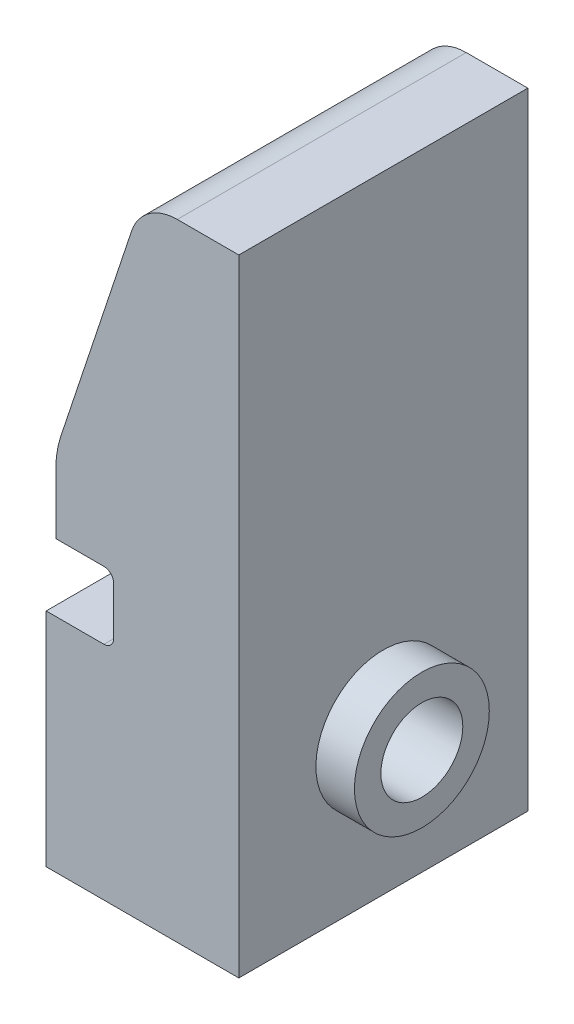
ISO-10303-21;
HEADER;
FILE_DESCRIPTION(('STEP AP214'),'2;1');
FILE_NAME('part.step','',(''),(''),'','','');
FILE_SCHEMA(('AUTOMOTIVE_DESIGN { 1 0 10303 214 1 1 1 1 }'));
ENDSEC;
DATA;
#1=APPLICATION_CONTEXT('core data for automotive mechanical design processes');
#2=APPLICATION_PROTOCOL_DEFINITION('international standard','automotive_design',2000,#1);
#3=PRODUCT_CONTEXT('',#1,'mechanical');
#4=PRODUCT('Part','Part','',(#3));
#5=PRODUCT_RELATED_PRODUCT_CATEGORY('part','',(#4));
#6=PRODUCT_DEFINITION_FORMATION('','',#4);
#7=PRODUCT_DEFINITION_CONTEXT('part definition',#1,'design');
#8=PRODUCT_DEFINITION('design','',#6,#7);
#9=PRODUCT_DEFINITION_SHAPE('','',#8);
#10=(LENGTH_UNIT() NAMED_UNIT(*) SI_UNIT(.MILLI.,.METRE.));
#11=(NAMED_UNIT(*) PLANE_ANGLE_UNIT() SI_UNIT($,.RADIAN.));
#12=(NAMED_UNIT(*) SI_UNIT($,.STERADIAN.) SOLID_ANGLE_UNIT());
#13=UNCERTAINTY_MEASURE_WITH_UNIT(LENGTH_MEASURE(1.E-05),#10,'distance_accuracy_value','');
#14=(GEOMETRIC_REPRESENTATION_CONTEXT(3) GLOBAL_UNCERTAINTY_ASSIGNED_CONTEXT((#13)) GLOBAL_UNIT_ASSIGNED_CONTEXT((#10,
#11,#12)) REPRESENTATION_CONTEXT('',''));
#15=CARTESIAN_POINT('',(0.,0.,0.));
#16=DIRECTION('',(0.,0.,1.));
#17=DIRECTION('',(1.,0.,0.));
#18=AXIS2_PLACEMENT_3D('',#15,#16,#17);
#19=CARTESIAN_POINT('',(5.66801619433198,33.7246963562753,30.));
#20=DIRECTION('',(-1.,0.,0.));
#21=DIRECTION('',(0.,-1.,0.));
#22=AXIS2_PLACEMENT_3D('',#19,#20,#21);
#23=PLANE('',#22);
#24=DIRECTION('',(0.,1.,0.));
#25=VECTOR('',#24,1.);
#26=CARTESIAN_POINT('',(5.66801619433198,33.7246963562753,0.));
#27=LINE('',#26,#25);
#28=CARTESIAN_POINT('',(5.66801619433199,-31.2753036437247,0.));
#29=VERTEX_POINT('',#28);
#30=CARTESIAN_POINT('',(5.66801619433198,33.7246963562753,0.));
#31=VERTEX_POINT('',#30);
#32=EDGE_CURVE('E286',#29,#31,#27,.T.);
#33=ORIENTED_EDGE('',*,*,#32,.T.);
#34=DIRECTION('',(0.,0.,-1.));
#35=VECTOR('',#34,1.);
#36=CARTESIAN_POINT('',(5.66801619433198,33.7246963562753,30.));
#37=LINE('',#36,#35);
#38=CARTESIAN_POINT('',(5.66801619433198,33.7246963562753,30.));
#39=VERTEX_POINT('',#38);
#40=EDGE_CURVE('E298',#39,#31,#37,.T.);
#41=ORIENTED_EDGE('',*,*,#40,.F.);
#42=DIRECTION('',(0.,1.,0.));
#43=VECTOR('',#42,1.);
#44=CARTESIAN_POINT('',(5.66801619433198,33.7246963562753,30.));
#45=LINE('',#44,#43);
#46=CARTESIAN_POINT('',(5.66801619433199,-31.2753036437247,30.));
#47=VERTEX_POINT('',#46);
#48=EDGE_CURVE('E270',#47,#39,#45,.T.);
#49=ORIENTED_EDGE('',*,*,#48,.F.);
#50=DIRECTION('',(0.,0.,-1.));
#51=VECTOR('',#50,1.);
#52=CARTESIAN_POINT('',(5.66801619433199,-31.2753036437247,30.));
#53=LINE('',#52,#51);
#54=EDGE_CURVE('E184',#47,#29,#53,.T.);
#55=ORIENTED_EDGE('',*,*,#54,.T.);
#56=EDGE_LOOP('',(#33,#41,#49,#55));
#57=FACE_BOUND('',#56,.T.);
#58=CARTESIAN_POINT('',(5.66801619433198,-16.2753036437247,15.));
#59=DIRECTION('',(-1.,0.,0.));
#60=DIRECTION('',(0.,-1.,0.));
#61=AXIS2_PLACEMENT_3D('',#58,#59,#60);
#62=CIRCLE('',#61,7.);
#63=CARTESIAN_POINT('',(5.66801619433198,-23.2753036437247,15.));
#64=VERTEX_POINT('',#63);
#65=EDGE_CURVE('E11',#64,#64,#62,.F.);
#66=ORIENTED_EDGE('',*,*,#65,.F.);
#67=EDGE_LOOP('',(#66));
#68=FACE_BOUND('',#67,.T.);
#69=ADVANCED_FACE('F35',(#57,#68),#23,.F.);
#70=CARTESIAN_POINT('',(-14.331983805668,-1.27530364372471,30.));
#71=DIRECTION('',(0.,-1.,0.));
#72=DIRECTION('',(1.,0.,0.));
#73=AXIS2_PLACEMENT_3D('',#70,#71,#72);
#74=PLANE('',#73);
#75=DIRECTION('',(-1.,0.,0.));
#76=VECTOR('',#75,1.);
#77=CARTESIAN_POINT('',(-14.331983805668,-1.27530364372471,10.));
#78=LINE('',#77,#76);
#79=CARTESIAN_POINT('',(-13.331983805668,-1.27530364372471,10.));
#80=VERTEX_POINT('',#79);
#81=CARTESIAN_POINT('',(-14.331983805668,-1.27530364372471,10.));
#82=VERTEX_POINT('',#81);
#83=EDGE_CURVE('E153',#80,#82,#78,.T.);
#84=ORIENTED_EDGE('',*,*,#83,.F.);
#85=DIRECTION('',(0.,0.,-1.));
#86=VECTOR('',#85,1.);
#87=CARTESIAN_POINT('',(-13.331983805668,-1.2753036437247,30.));
#88=LINE('',#87,#86);
#89=CARTESIAN_POINT('',(-13.331983805668,-1.2753036437247,0.));
#90=VERTEX_POINT('',#89);
#91=EDGE_CURVE('E280',#80,#90,#88,.T.);
#92=ORIENTED_EDGE('',*,*,#91,.T.);
#93=DIRECTION('',(-1.,0.,0.));
#94=VECTOR('',#93,1.);
#95=CARTESIAN_POINT('',(-14.331983805668,-1.27530364372471,0.));
#96=LINE('',#95,#94);
#97=CARTESIAN_POINT('',(-14.331983805668,-1.27530364372471,0.));
#98=VERTEX_POINT('',#97);
#99=EDGE_CURVE('E176',#90,#98,#96,.T.);
#100=ORIENTED_EDGE('',*,*,#99,.T.);
#101=DIRECTION('',(0.,0.,-1.));
#102=VECTOR('',#101,1.);
#103=CARTESIAN_POINT('',(-14.331983805668,-1.27530364372471,30.));
#104=LINE('',#103,#102);
#105=EDGE_CURVE('E166',#82,#98,#104,.T.);
#106=ORIENTED_EDGE('',*,*,#105,.F.);
#107=EDGE_LOOP('',(#84,#92,#100,#106));
#108=FACE_BOUND('',#107,.T.);
#109=ADVANCED_FACE('F174',(#108),#74,.F.);
#110=CARTESIAN_POINT('',(-14.331983805668,-1.27530364372471,30.));
#111=DIRECTION('',(1.,0.,0.));
#112=DIRECTION('',(0.,1.,0.));
#113=AXIS2_PLACEMENT_3D('',#110,#111,#112);
#114=PLANE('',#113);
#115=CARTESIAN_POINT('',(-14.331983805668,-16.2753036437247,15.));
#116=DIRECTION('',(-1.,0.,0.));
#117=DIRECTION('',(0.,-1.,0.));
#118=AXIS2_PLACEMENT_3D('',#115,#116,#117);
#119=CIRCLE('',#118,4.25);
#120=CARTESIAN_POINT('',(-14.331983805668,-20.5253036437247,15.));
#121=VERTEX_POINT('',#120);
#122=EDGE_CURVE('E262',#121,#121,#119,.T.);
#123=ORIENTED_EDGE('',*,*,#122,.F.);
#124=EDGE_LOOP('',(#123));
#125=FACE_BOUND('',#124,.T.);
#126=DIRECTION('',(0.,-1.,0.));
#127=VECTOR('',#126,1.);
#128=CARTESIAN_POINT('',(-14.331983805668,-1.27530364372471,30.));
#129=LINE('',#128,#127);
#130=CARTESIAN_POINT('',(-14.331983805668,-8.27530364372471,30.));
#131=VERTEX_POINT('',#130);
#132=CARTESIAN_POINT('',(-14.331983805668,-31.2753036437247,30.));
#133=VERTEX_POINT('',#132);
#134=EDGE_CURVE('E265',#131,#133,#129,.T.);
#135=ORIENTED_EDGE('',*,*,#134,.F.);
#136=DIRECTION('',(0.,0.,1.));
#137=VECTOR('',#136,1.);
#138=CARTESIAN_POINT('',(-14.331983805668,-8.27530364372471,10.));
#139=LINE('',#138,#137);
#140=CARTESIAN_POINT('',(-14.331983805668,-8.27530364372471,11.));
#141=VERTEX_POINT('',#140);
#142=EDGE_CURVE('E161',#141,#131,#139,.T.);
#143=ORIENTED_EDGE('',*,*,#142,.F.);
#144=CARTESIAN_POINT('',(-14.331983805668,-7.27530364372471,11.));
#145=DIRECTION('',(1.,0.,0.));
#146=DIRECTION('',(0.,1.,0.));
#147=AXIS2_PLACEMENT_3D('',#144,#145,#146);
#148=CIRCLE('',#147,1.);
#149=CARTESIAN_POINT('',(-14.331983805668,-7.27530364372471,10.));
#150=VERTEX_POINT('',#149);
#151=EDGE_CURVE('E170',#141,#150,#148,.T.);
#152=ORIENTED_EDGE('',*,*,#151,.T.);
#153=DIRECTION('',(0.,-1.,0.));
#154=VECTOR('',#153,1.);
#155=CARTESIAN_POINT('',(-14.331983805668,-1.27530364372471,10.));
#156=LINE('',#155,#154);
#157=EDGE_CURVE('E156',#82,#150,#156,.T.);
#158=ORIENTED_EDGE('',*,*,#157,.F.);
#159=ORIENTED_EDGE('',*,*,#105,.T.);
#160=DIRECTION('',(0.,-1.,0.));
#161=VECTOR('',#160,1.);
#162=CARTESIAN_POINT('',(-14.331983805668,-1.27530364372471,0.));
#163=LINE('',#162,#161);
#164=CARTESIAN_POINT('',(-14.331983805668,-31.2753036437247,0.));
#165=VERTEX_POINT('',#164);
#166=EDGE_CURVE('E282',#98,#165,#163,.T.);
#167=ORIENTED_EDGE('',*,*,#166,.T.);
#168=DIRECTION('',(0.,0.,-1.));
#169=VECTOR('',#168,1.);
#170=CARTESIAN_POINT('',(-14.331983805668,-31.2753036437247,30.));
#171=LINE('',#170,#169);
#172=EDGE_CURVE('E178',#133,#165,#171,.T.);
#173=ORIENTED_EDGE('',*,*,#172,.F.);
#174=EDGE_LOOP('',(#135,#143,#152,#158,#159,#167,#173));
#175=FACE_BOUND('',#174,.T.);
#176=ADVANCED_FACE('F165',(#125,#175),#114,.F.);
#177=CARTESIAN_POINT('',(-14.331983805668,-31.2753036437247,30.));
#178=DIRECTION('',(0.,1.,0.));
#179=DIRECTION('',(0.,0.,1.));
#180=AXIS2_PLACEMENT_3D('',#177,#178,#179);
#181=PLANE('',#180);
#182=DIRECTION('',(1.,0.,0.));
#183=VECTOR('',#182,1.);
#184=CARTESIAN_POINT('',(-14.331983805668,-31.2753036437247,0.));
#185=LINE('',#184,#183);
#186=EDGE_CURVE('E284',#165,#29,#185,.T.);
#187=ORIENTED_EDGE('',*,*,#186,.T.);
#188=ORIENTED_EDGE('',*,*,#54,.F.);
#189=DIRECTION('',(1.,0.,0.));
#190=VECTOR('',#189,1.);
#191=CARTESIAN_POINT('',(-14.331983805668,-31.2753036437247,30.));
#192=LINE('',#191,#190);
#193=EDGE_CURVE('E267',#133,#47,#192,.T.);
#194=ORIENTED_EDGE('',*,*,#193,.F.);
#195=ORIENTED_EDGE('',*,*,#172,.T.);
#196=EDGE_LOOP('',(#187,#188,#194,#195));
#197=FACE_BOUND('',#196,.T.);
#198=ADVANCED_FACE('F361',(#197),#181,.F.);
#199=CARTESIAN_POINT('',(-4.33198380566802,33.7246963562753,30.));
#200=DIRECTION('',(0.,-1.,0.));
#201=DIRECTION('',(0.,0.,-1.));
#202=AXIS2_PLACEMENT_3D('',#199,#200,#201);
#203=PLANE('',#202);
#204=DIRECTION('',(-1.,0.,0.));
#205=VECTOR('',#204,1.);
#206=CARTESIAN_POINT('',(-4.33198380566802,33.7246963562753,0.));
#207=LINE('',#206,#205);
#208=CARTESIAN_POINT('',(-0.723758416846672,33.7246963562753,0.));
#209=VERTEX_POINT('',#208);
#210=EDGE_CURVE('E288',#31,#209,#207,.T.);
#211=ORIENTED_EDGE('',*,*,#210,.T.);
#212=DIRECTION('',(0.,0.,-1.));
#213=VECTOR('',#212,1.);
#214=CARTESIAN_POINT('',(-0.723758416846672,33.7246963562753,30.));
#215=LINE('',#214,#213);
#216=CARTESIAN_POINT('',(-0.723758416846672,33.7246963562753,30.));
#217=VERTEX_POINT('',#216);
#218=EDGE_CURVE('E200',#209,#217,#215,.F.);
#219=ORIENTED_EDGE('',*,*,#218,.T.);
#220=DIRECTION('',(-1.,0.,0.));
#221=VECTOR('',#220,1.);
#222=CARTESIAN_POINT('',(-4.33198380566802,33.7246963562753,30.));
#223=LINE('',#222,#221);
#224=EDGE_CURVE('E272',#39,#217,#223,.T.);
#225=ORIENTED_EDGE('',*,*,#224,.F.);
#226=ORIENTED_EDGE('',*,*,#40,.T.);
#227=EDGE_LOOP('',(#211,#219,#225,#226));
#228=FACE_BOUND('',#227,.T.);
#229=ADVANCED_FACE('F316',(#228),#203,.F.);
#230=CARTESIAN_POINT('',(-4.33198380566802,33.7246963562753,30.));
#231=DIRECTION('',(0.94905121728834,-0.315121860497682,0.));
#232=DIRECTION('',(0.315121860497682,0.94905121728834,0.));
#233=AXIS2_PLACEMENT_3D('',#230,#231,#232);
#234=PLANE('',#233);
#235=DIRECTION('',(-0.315121860497682,-0.94905121728834,0.));
#236=VECTOR('',#235,1.);
#237=CARTESIAN_POINT('',(-4.33198380566802,33.7246963562753,30.));
#238=LINE('',#237,#236);
#239=CARTESIAN_POINT('',(-5.46901450328837,30.3003056587637,30.));
#240=VERTEX_POINT('',#239);
#241=CARTESIAN_POINT('',(-12.8224959785514,8.15385560168494,30.));
#242=VERTEX_POINT('',#241);
#243=EDGE_CURVE('E275',#240,#242,#238,.T.);
#244=ORIENTED_EDGE('',*,*,#243,.F.);
#245=DIRECTION('',(0.,0.,-1.));
#246=VECTOR('',#245,1.);
#247=CARTESIAN_POINT('',(-5.46901450328837,30.3003056587637,30.));
#248=LINE('',#247,#246);
#249=CARTESIAN_POINT('',(-5.46901450328837,30.3003056587637,0.));
#250=VERTEX_POINT('',#249);
#251=EDGE_CURVE('E195',#240,#250,#248,.T.);
#252=ORIENTED_EDGE('',*,*,#251,.T.);
#253=DIRECTION('',(-0.315121860497682,-0.94905121728834,0.));
#254=VECTOR('',#253,1.);
#255=CARTESIAN_POINT('',(-4.33198380566802,33.7246963562753,0.));
#256=LINE('',#255,#254);
#257=CARTESIAN_POINT('',(-12.8224959785514,8.15385560168494,0.));
#258=VERTEX_POINT('',#257);
#259=EDGE_CURVE('E291',#250,#258,#256,.T.);
#260=ORIENTED_EDGE('',*,*,#259,.T.);
#261=DIRECTION('',(0.,0.,-1.));
#262=VECTOR('',#261,1.);
#263=CARTESIAN_POINT('',(-12.8224959785514,8.15385560168494,30.));
#264=LINE('',#263,#262);
#265=EDGE_CURVE('E190',#258,#242,#264,.F.);
#266=ORIENTED_EDGE('',*,*,#265,.T.);
#267=EDGE_LOOP('',(#244,#252,#260,#266));
#268=FACE_BOUND('',#267,.T.);
#269=ADVANCED_FACE('F327',(#268),#234,.F.);
#270=CARTESIAN_POINT('',(-13.331983805668,-1.2753036437247,30.));
#271=DIRECTION('',(1.,0.,0.));
#272=DIRECTION('',(0.,0.,-1.));
#273=AXIS2_PLACEMENT_3D('',#270,#271,#272);
#274=PLANE('',#273);
#275=DIRECTION('',(0.,-1.,0.));
#276=VECTOR('',#275,1.);
#277=CARTESIAN_POINT('',(-13.331983805668,-1.2753036437247,30.));
#278=LINE('',#277,#276);
#279=CARTESIAN_POINT('',(-13.331983805668,5.00263699670813,30.));
#280=VERTEX_POINT('',#279);
#281=CARTESIAN_POINT('',(-13.331983805668,-1.27530364372471,30.));
#282=VERTEX_POINT('',#281);
#283=EDGE_CURVE('E277',#280,#282,#278,.T.);
#284=ORIENTED_EDGE('',*,*,#283,.F.);
#285=DIRECTION('',(0.,0.,-1.));
#286=VECTOR('',#285,1.);
#287=CARTESIAN_POINT('',(-13.331983805668,5.00263699670813,30.));
#288=LINE('',#287,#286);
#289=CARTESIAN_POINT('',(-13.331983805668,5.00263699670813,0.));
#290=VERTEX_POINT('',#289);
#291=EDGE_CURVE('E177',#280,#290,#288,.T.);
#292=ORIENTED_EDGE('',*,*,#291,.T.);
#293=DIRECTION('',(0.,-1.,0.));
#294=VECTOR('',#293,1.);
#295=CARTESIAN_POINT('',(-13.331983805668,-1.2753036437247,0.));
#296=LINE('',#295,#294);
#297=EDGE_CURVE('E268',#290,#90,#296,.T.);
#298=ORIENTED_EDGE('',*,*,#297,.T.);
#299=ORIENTED_EDGE('',*,*,#91,.F.);
#300=DIRECTION('',(0.,1.,0.));
#301=VECTOR('',#300,1.);
#302=CARTESIAN_POINT('',(-13.331983805668,0.,10.));
#303=LINE('',#302,#301);
#304=CARTESIAN_POINT('',(-13.331983805668,-2.27530364372471,10.));
#305=VERTEX_POINT('',#304);
#306=EDGE_CURVE('E157',#305,#80,#303,.T.);
#307=ORIENTED_EDGE('',*,*,#306,.F.);
#308=CARTESIAN_POINT('',(-13.331983805668,-2.27530364372471,11.));
#309=DIRECTION('',(1.,0.,0.));
#310=DIRECTION('',(0.,0.,-1.));
#311=AXIS2_PLACEMENT_3D('',#308,#309,#310);
#312=CIRCLE('',#311,1.);
#313=CARTESIAN_POINT('',(-13.331983805668,-1.2753036437247,11.));
#314=VERTEX_POINT('',#313);
#315=EDGE_CURVE('E43',#305,#314,#312,.T.);
#316=ORIENTED_EDGE('',*,*,#315,.T.);
#317=EDGE_CURVE('E295',#282,#314,#88,.T.);
#318=ORIENTED_EDGE('',*,*,#317,.F.);
#319=EDGE_LOOP('',(#284,#292,#298,#299,#307,#316,#318));
#320=FACE_BOUND('',#319,.T.);
#321=ADVANCED_FACE('F336',(#320),#274,.F.);
#322=CARTESIAN_POINT('',(0.,0.,30.));
#323=DIRECTION('',(0.,0.,1.));
#324=DIRECTION('',(1.,0.,0.));
#325=AXIS2_PLACEMENT_3D('',#322,#323,#324);
#326=PLANE('',#325);
#327=DIRECTION('',(-1.,0.,0.));
#328=VECTOR('',#327,1.);
#329=CARTESIAN_POINT('',(-14.331983805668,-1.27530364372471,30.));
#330=LINE('',#329,#328);
#331=CARTESIAN_POINT('',(-8.33198380566802,-1.27530364372471,30.));
#332=VERTEX_POINT('',#331);
#333=EDGE_CURVE('E171',#332,#282,#330,.T.);
#334=ORIENTED_EDGE('',*,*,#333,.F.);
#335=CARTESIAN_POINT('',(-8.33198380566802,-2.27530364372471,30.));
#336=DIRECTION('',(0.,0.,1.));
#337=DIRECTION('',(1.,0.,0.));
#338=AXIS2_PLACEMENT_3D('',#335,#336,#337);
#339=CIRCLE('',#338,1.);
#340=CARTESIAN_POINT('',(-7.33198380566801,-2.27530364372471,30.));
#341=VERTEX_POINT('',#340);
#342=EDGE_CURVE('E224',#332,#341,#339,.F.);
#343=ORIENTED_EDGE('',*,*,#342,.T.);
#344=DIRECTION('',(0.,1.,0.));
#345=VECTOR('',#344,1.);
#346=CARTESIAN_POINT('',(-7.33198380566801,-1.27530364372471,30.));
#347=LINE('',#346,#345);
#348=CARTESIAN_POINT('',(-7.33198380566801,-7.27530364372471,30.));
#349=VERTEX_POINT('',#348);
#350=EDGE_CURVE('E252',#349,#341,#347,.T.);
#351=ORIENTED_EDGE('',*,*,#350,.F.);
#352=CARTESIAN_POINT('',(-8.33198380566802,-7.27530364372471,30.));
#353=DIRECTION('',(0.,0.,1.));
#354=DIRECTION('',(1.,0.,0.));
#355=AXIS2_PLACEMENT_3D('',#352,#353,#354);
#356=CIRCLE('',#355,1.);
#357=CARTESIAN_POINT('',(-8.33198380566802,-8.27530364372471,30.));
#358=VERTEX_POINT('',#357);
#359=EDGE_CURVE('E226',#349,#358,#356,.F.);
#360=ORIENTED_EDGE('',*,*,#359,.T.);
#361=DIRECTION('',(1.,0.,0.));
#362=VECTOR('',#361,1.);
#363=CARTESIAN_POINT('',(-14.331983805668,-8.27530364372471,30.));
#364=LINE('',#363,#362);
#365=EDGE_CURVE('E247',#131,#358,#364,.T.);
#366=ORIENTED_EDGE('',*,*,#365,.F.);
#367=ORIENTED_EDGE('',*,*,#134,.T.);
#368=ORIENTED_EDGE('',*,*,#193,.T.);
#369=ORIENTED_EDGE('',*,*,#48,.T.);
#370=ORIENTED_EDGE('',*,*,#224,.T.);
#371=CARTESIAN_POINT('',(-0.723758416846672,28.7246963562753,30.));
#372=DIRECTION('',(0.,0.,1.));
#373=DIRECTION('',(1.,0.,0.));
#374=AXIS2_PLACEMENT_3D('',#371,#372,#373);
#375=CIRCLE('',#374,5.);
#376=EDGE_CURVE('E202',#217,#240,#375,.T.);
#377=ORIENTED_EDGE('',*,*,#376,.T.);
#378=ORIENTED_EDGE('',*,*,#243,.T.);
#379=CARTESIAN_POINT('',(-3.33198380566801,5.00263699670813,30.));
#380=DIRECTION('',(0.,0.,1.));
#381=DIRECTION('',(1.,0.,0.));
#382=AXIS2_PLACEMENT_3D('',#379,#380,#381);
#383=CIRCLE('',#382,10.);
#384=EDGE_CURVE('E193',#242,#280,#383,.T.);
#385=ORIENTED_EDGE('',*,*,#384,.T.);
#386=ORIENTED_EDGE('',*,*,#283,.T.);
#387=EDGE_LOOP('',(#334,#343,#351,#360,#366,#367,#368,#369,#370,#377,#378,#385,#386));
#388=FACE_BOUND('',#387,.T.);
#389=ADVANCED_FACE('F325',(#388),#326,.T.);
#390=CARTESIAN_POINT('',(0.,0.,0.));
#391=DIRECTION('',(0.,0.,1.));
#392=DIRECTION('',(1.,0.,0.));
#393=AXIS2_PLACEMENT_3D('',#390,#391,#392);
#394=PLANE('',#393);
#395=ORIENTED_EDGE('',*,*,#259,.F.);
#396=CARTESIAN_POINT('',(-0.723758416846672,28.7246963562753,0.));
#397=DIRECTION('',(0.,0.,1.));
#398=DIRECTION('',(1.,0.,0.));
#399=AXIS2_PLACEMENT_3D('',#396,#397,#398);
#400=CIRCLE('',#399,5.);
#401=EDGE_CURVE('E198',#250,#209,#400,.F.);
#402=ORIENTED_EDGE('',*,*,#401,.T.);
#403=ORIENTED_EDGE('',*,*,#210,.F.);
#404=ORIENTED_EDGE('',*,*,#32,.F.);
#405=ORIENTED_EDGE('',*,*,#186,.F.);
#406=ORIENTED_EDGE('',*,*,#166,.F.);
#407=ORIENTED_EDGE('',*,*,#99,.F.);
#408=ORIENTED_EDGE('',*,*,#297,.F.);
#409=CARTESIAN_POINT('',(-3.33198380566801,5.00263699670813,0.));
#410=DIRECTION('',(0.,0.,1.));
#411=DIRECTION('',(1.,0.,0.));
#412=AXIS2_PLACEMENT_3D('',#409,#410,#411);
#413=CIRCLE('',#412,10.);
#414=EDGE_CURVE('E181',#290,#258,#413,.F.);
#415=ORIENTED_EDGE('',*,*,#414,.T.);
#416=EDGE_LOOP('',(#395,#402,#403,#404,#405,#406,#407,#408,#415));
#417=FACE_BOUND('',#416,.T.);
#418=ADVANCED_FACE('F313',(#417),#394,.F.);
#419=CARTESIAN_POINT('',(15.668016194332,-16.2753036437247,15.));
#420=DIRECTION('',(-1.,0.,0.));
#421=DIRECTION('',(0.,-1.,0.));
#422=AXIS2_PLACEMENT_3D('',#419,#420,#421);
#423=CYLINDRICAL_SURFACE('',#422,4.25);
#424=ORIENTED_EDGE('',*,*,#122,.T.);
#425=EDGE_LOOP('',(#424));
#426=FACE_BOUND('',#425,.T.);
#427=CARTESIAN_POINT('',(9.66801619433198,-16.2753036437247,15.));
#428=DIRECTION('',(1.,0.,0.));
#429=DIRECTION('',(0.,1.,0.));
#430=AXIS2_PLACEMENT_3D('',#427,#428,#429);
#431=CIRCLE('',#430,4.25);
#432=CARTESIAN_POINT('',(9.66801619433198,-12.0253036437247,15.));
#433=VERTEX_POINT('',#432);
#434=EDGE_CURVE('E415',#433,#433,#431,.T.);
#435=ORIENTED_EDGE('',*,*,#434,.T.);
#436=EDGE_LOOP('',(#435));
#437=FACE_BOUND('',#436,.T.);
#438=ADVANCED_FACE('F384',(#426,#437),#423,.F.);
#439=CARTESIAN_POINT('',(-3.33198380566801,5.00263699670813,30.));
#440=DIRECTION('',(0.,0.,-1.));
#441=DIRECTION('',(-1.,0.,0.));
#442=AXIS2_PLACEMENT_3D('',#439,#440,#441);
#443=CYLINDRICAL_SURFACE('',#442,10.);
#444=ORIENTED_EDGE('',*,*,#384,.F.);
#445=ORIENTED_EDGE('',*,*,#265,.F.);
#446=ORIENTED_EDGE('',*,*,#414,.F.);
#447=ORIENTED_EDGE('',*,*,#291,.F.);
#448=EDGE_LOOP('',(#444,#445,#446,#447));
#449=FACE_BOUND('',#448,.T.);
#450=ADVANCED_FACE('F332',(#449),#443,.T.);
#451=CARTESIAN_POINT('',(-0.723758416846672,28.7246963562753,30.));
#452=DIRECTION('',(0.,0.,-1.));
#453=DIRECTION('',(-1.,0.,0.));
#454=AXIS2_PLACEMENT_3D('',#451,#452,#453);
#455=CYLINDRICAL_SURFACE('',#454,5.);
#456=ORIENTED_EDGE('',*,*,#376,.F.);
#457=ORIENTED_EDGE('',*,*,#218,.F.);
#458=ORIENTED_EDGE('',*,*,#401,.F.);
#459=ORIENTED_EDGE('',*,*,#251,.F.);
#460=EDGE_LOOP('',(#456,#457,#458,#459));
#461=FACE_BOUND('',#460,.T.);
#462=ADVANCED_FACE('F320',(#461),#455,.T.);
#463=CARTESIAN_POINT('',(-14.331983805668,-1.27530364372471,10.));
#464=DIRECTION('',(0.,1.,0.));
#465=DIRECTION('',(0.,0.,1.));
#466=AXIS2_PLACEMENT_3D('',#463,#464,#465);
#467=PLANE('',#466);
#468=DIRECTION('',(-1.,0.,0.));
#469=VECTOR('',#468,1.);
#470=CARTESIAN_POINT('',(-14.331983805668,-1.27530364372471,11.));
#471=LINE('',#470,#469);
#472=CARTESIAN_POINT('',(-8.33198380566802,-1.27530364372471,11.));
#473=VERTEX_POINT('',#472);
#474=EDGE_CURVE('E204',#314,#473,#471,.F.);
#475=ORIENTED_EDGE('',*,*,#474,.T.);
#476=DIRECTION('',(0.,0.,1.));
#477=VECTOR('',#476,1.);
#478=CARTESIAN_POINT('',(-8.33198380566802,-1.27530364372471,30.));
#479=LINE('',#478,#477);
#480=EDGE_CURVE('E206',#473,#332,#479,.T.);
#481=ORIENTED_EDGE('',*,*,#480,.T.);
#482=ORIENTED_EDGE('',*,*,#333,.T.);
#483=ORIENTED_EDGE('',*,*,#317,.T.);
#484=EDGE_LOOP('',(#475,#481,#482,#483));
#485=FACE_BOUND('',#484,.T.);
#486=ADVANCED_FACE('F341',(#485),#467,.F.);
#487=CARTESIAN_POINT('',(-7.33198380566801,-1.27530364372471,10.));
#488=DIRECTION('',(1.,0.,0.));
#489=DIRECTION('',(0.,1.,0.));
#490=AXIS2_PLACEMENT_3D('',#487,#488,#489);
#491=PLANE('',#490);
#492=ORIENTED_EDGE('',*,*,#350,.T.);
#493=DIRECTION('',(0.,0.,1.));
#494=VECTOR('',#493,1.);
#495=CARTESIAN_POINT('',(-7.33198380566801,-2.27530364372471,10.));
#496=LINE('',#495,#494);
#497=CARTESIAN_POINT('',(-7.33198380566801,-2.27530364372471,11.));
#498=VERTEX_POINT('',#497);
#499=EDGE_CURVE('E213',#341,#498,#496,.F.);
#500=ORIENTED_EDGE('',*,*,#499,.T.);
#501=DIRECTION('',(0.,1.,0.));
#502=VECTOR('',#501,1.);
#503=CARTESIAN_POINT('',(-7.33198380566801,-1.27530364372471,11.));
#504=LINE('',#503,#502);
#505=CARTESIAN_POINT('',(-7.33198380566801,-7.27530364372471,11.));
#506=VERTEX_POINT('',#505);
#507=EDGE_CURVE('E209',#498,#506,#504,.F.);
#508=ORIENTED_EDGE('',*,*,#507,.T.);
#509=DIRECTION('',(0.,0.,1.));
#510=VECTOR('',#509,1.);
#511=CARTESIAN_POINT('',(-7.33198380566801,-7.27530364372471,30.));
#512=LINE('',#511,#510);
#513=EDGE_CURVE('E211',#506,#349,#512,.T.);
#514=ORIENTED_EDGE('',*,*,#513,.T.);
#515=EDGE_LOOP('',(#492,#500,#508,#514));
#516=FACE_BOUND('',#515,.T.);
#517=ADVANCED_FACE('F356',(#516),#491,.F.);
#518=CARTESIAN_POINT('',(-14.331983805668,-8.27530364372471,10.));
#519=DIRECTION('',(0.,-1.,0.));
#520=DIRECTION('',(0.,0.,-1.));
#521=AXIS2_PLACEMENT_3D('',#518,#519,#520);
#522=PLANE('',#521);
#523=ORIENTED_EDGE('',*,*,#365,.T.);
#524=DIRECTION('',(0.,0.,1.));
#525=VECTOR('',#524,1.);
#526=CARTESIAN_POINT('',(-8.33198380566802,-8.27530364372471,10.));
#527=LINE('',#526,#525);
#528=CARTESIAN_POINT('',(-8.33198380566802,-8.27530364372471,11.));
#529=VERTEX_POINT('',#528);
#530=EDGE_CURVE('E217',#358,#529,#527,.F.);
#531=ORIENTED_EDGE('',*,*,#530,.T.);
#532=DIRECTION('',(1.,0.,0.));
#533=VECTOR('',#532,1.);
#534=CARTESIAN_POINT('',(-14.331983805668,-8.27530364372471,11.));
#535=LINE('',#534,#533);
#536=EDGE_CURVE('E215',#529,#141,#535,.F.);
#537=ORIENTED_EDGE('',*,*,#536,.T.);
#538=ORIENTED_EDGE('',*,*,#142,.T.);
#539=EDGE_LOOP('',(#523,#531,#537,#538));
#540=FACE_BOUND('',#539,.T.);
#541=ADVANCED_FACE('F390',(#540),#522,.F.);
#542=CARTESIAN_POINT('',(0.,0.,10.));
#543=DIRECTION('',(0.,0.,1.));
#544=DIRECTION('',(1.,0.,0.));
#545=AXIS2_PLACEMENT_3D('',#542,#543,#544);
#546=PLANE('',#545);
#547=ORIENTED_EDGE('',*,*,#157,.T.);
#548=DIRECTION('',(1.,0.,0.));
#549=VECTOR('',#548,1.);
#550=CARTESIAN_POINT('',(0.,-7.27530364372471,10.));
#551=LINE('',#550,#549);
#552=CARTESIAN_POINT('',(-8.33198380566802,-7.27530364372471,10.));
#553=VERTEX_POINT('',#552);
#554=EDGE_CURVE('E50',#150,#553,#551,.T.);
#555=ORIENTED_EDGE('',*,*,#554,.T.);
#556=DIRECTION('',(0.,1.,0.));
#557=VECTOR('',#556,1.);
#558=CARTESIAN_POINT('',(-8.33198380566802,0.,10.));
#559=LINE('',#558,#557);
#560=CARTESIAN_POINT('',(-8.33198380566802,-2.27530364372471,10.));
#561=VERTEX_POINT('',#560);
#562=EDGE_CURVE('E55',#553,#561,#559,.T.);
#563=ORIENTED_EDGE('',*,*,#562,.T.);
#564=DIRECTION('',(-1.,0.,0.));
#565=VECTOR('',#564,1.);
#566=CARTESIAN_POINT('',(0.,-2.27530364372471,10.));
#567=LINE('',#566,#565);
#568=EDGE_CURVE('E220',#561,#305,#567,.T.);
#569=ORIENTED_EDGE('',*,*,#568,.T.);
#570=ORIENTED_EDGE('',*,*,#306,.T.);
#571=ORIENTED_EDGE('',*,*,#83,.T.);
#572=EDGE_LOOP('',(#547,#555,#563,#569,#570,#571));
#573=FACE_BOUND('',#572,.T.);
#574=ADVANCED_FACE('F155',(#573),#546,.T.);
#575=CARTESIAN_POINT('',(-8.33198380566802,-7.27530364372471,10.));
#576=DIRECTION('',(0.,0.,-1.));
#577=DIRECTION('',(-1.,0.,0.));
#578=AXIS2_PLACEMENT_3D('',#575,#576,#577);
#579=CYLINDRICAL_SURFACE('',#578,1.);
#580=ORIENTED_EDGE('',*,*,#359,.F.);
#581=ORIENTED_EDGE('',*,*,#513,.F.);
#582=CARTESIAN_POINT('',(-8.33198380566802,-7.27530364372471,11.));
#583=DIRECTION('',(0.,0.,1.));
#584=DIRECTION('',(1.,0.,0.));
#585=AXIS2_PLACEMENT_3D('',#582,#583,#584);
#586=CIRCLE('',#585,1.);
#587=EDGE_CURVE('E245',#529,#506,#586,.T.);
#588=ORIENTED_EDGE('',*,*,#587,.F.);
#589=ORIENTED_EDGE('',*,*,#530,.F.);
#590=EDGE_LOOP('',(#580,#581,#588,#589));
#591=FACE_BOUND('',#590,.T.);
#592=ADVANCED_FACE('F37',(#591),#579,.F.);
#593=CARTESIAN_POINT('',(0.,-7.27530364372471,11.));
#594=DIRECTION('',(1.,0.,0.));
#595=DIRECTION('',(0.,0.,-1.));
#596=AXIS2_PLACEMENT_3D('',#593,#594,#595);
#597=CYLINDRICAL_SURFACE('',#596,1.);
#598=ORIENTED_EDGE('',*,*,#151,.F.);
#599=ORIENTED_EDGE('',*,*,#536,.F.);
#600=CARTESIAN_POINT('',(-8.33198380566802,-7.27530364372471,11.));
#601=DIRECTION('',(-1.,0.,0.));
#602=DIRECTION('',(0.,0.,1.));
#603=AXIS2_PLACEMENT_3D('',#600,#601,#602);
#604=CIRCLE('',#603,1.);
#605=EDGE_CURVE('E243',#553,#529,#604,.T.);
#606=ORIENTED_EDGE('',*,*,#605,.F.);
#607=ORIENTED_EDGE('',*,*,#554,.F.);
#608=EDGE_LOOP('',(#598,#599,#606,#607));
#609=FACE_BOUND('',#608,.T.);
#610=ADVANCED_FACE('F436',(#609),#597,.F.);
#611=CARTESIAN_POINT('',(-8.33198380566802,-7.27530364372471,11.));
#612=DIRECTION('',(0.,0.,1.));
#613=DIRECTION('',(1.,0.,0.));
#614=AXIS2_PLACEMENT_3D('',#611,#612,#613);
#615=SPHERICAL_SURFACE('',#614,1.);
#616=ORIENTED_EDGE('',*,*,#605,.T.);
#617=ORIENTED_EDGE('',*,*,#587,.T.);
#618=CARTESIAN_POINT('',(-8.33198380566801,-7.27530364372471,11.));
#619=DIRECTION('',(0.,1.,0.));
#620=DIRECTION('',(0.,0.,1.));
#621=AXIS2_PLACEMENT_3D('',#618,#619,#620);
#622=CIRCLE('',#621,1.);
#623=EDGE_CURVE('E240',#553,#506,#622,.F.);
#624=ORIENTED_EDGE('',*,*,#623,.F.);
#625=EDGE_LOOP('',(#616,#617,#624));
#626=FACE_BOUND('',#625,.T.);
#627=ADVANCED_FACE('F433',(#626),#615,.F.);
#628=CARTESIAN_POINT('',(-8.33198380566802,0.,11.));
#629=DIRECTION('',(0.,1.,0.));
#630=DIRECTION('',(-1.,0.,0.));
#631=AXIS2_PLACEMENT_3D('',#628,#629,#630);
#632=CYLINDRICAL_SURFACE('',#631,1.);
#633=ORIENTED_EDGE('',*,*,#623,.T.);
#634=ORIENTED_EDGE('',*,*,#507,.F.);
#635=CARTESIAN_POINT('',(-8.33198380566802,-2.27530364372471,11.));
#636=DIRECTION('',(0.,-1.,0.));
#637=DIRECTION('',(0.,0.,-1.));
#638=AXIS2_PLACEMENT_3D('',#635,#636,#637);
#639=CIRCLE('',#638,1.);
#640=EDGE_CURVE('E237',#561,#498,#639,.T.);
#641=ORIENTED_EDGE('',*,*,#640,.F.);
#642=ORIENTED_EDGE('',*,*,#562,.F.);
#643=EDGE_LOOP('',(#633,#634,#641,#642));
#644=FACE_BOUND('',#643,.T.);
#645=ADVANCED_FACE('F430',(#644),#632,.F.);
#646=CARTESIAN_POINT('',(0.,-2.27530364372471,11.));
#647=DIRECTION('',(-1.,0.,0.));
#648=DIRECTION('',(0.,0.,1.));
#649=AXIS2_PLACEMENT_3D('',#646,#647,#648);
#650=CYLINDRICAL_SURFACE('',#649,1.);
#651=ORIENTED_EDGE('',*,*,#315,.F.);
#652=ORIENTED_EDGE('',*,*,#568,.F.);
#653=CARTESIAN_POINT('',(-8.33198380566802,-2.27530364372471,11.));
#654=DIRECTION('',(-1.,0.,0.));
#655=DIRECTION('',(0.,0.,1.));
#656=AXIS2_PLACEMENT_3D('',#653,#654,#655);
#657=CIRCLE('',#656,1.);
#658=EDGE_CURVE('E233',#473,#561,#657,.T.);
#659=ORIENTED_EDGE('',*,*,#658,.F.);
#660=ORIENTED_EDGE('',*,*,#474,.F.);
#661=EDGE_LOOP('',(#651,#652,#659,#660));
#662=FACE_BOUND('',#661,.T.);
#663=ADVANCED_FACE('F344',(#662),#650,.F.);
#664=CARTESIAN_POINT('',(-8.33198380566802,-2.27530364372471,11.));
#665=DIRECTION('',(0.,0.,1.));
#666=DIRECTION('',(1.,0.,0.));
#667=AXIS2_PLACEMENT_3D('',#664,#665,#666);
#668=SPHERICAL_SURFACE('',#667,1.);
#669=ORIENTED_EDGE('',*,*,#658,.T.);
#670=ORIENTED_EDGE('',*,*,#640,.T.);
#671=CARTESIAN_POINT('',(-8.33198380566802,-2.27530364372471,11.));
#672=DIRECTION('',(0.,0.,1.));
#673=DIRECTION('',(1.,0.,0.));
#674=AXIS2_PLACEMENT_3D('',#671,#672,#673);
#675=CIRCLE('',#674,1.);
#676=EDGE_CURVE('E230',#473,#498,#675,.F.);
#677=ORIENTED_EDGE('',*,*,#676,.F.);
#678=EDGE_LOOP('',(#669,#670,#677));
#679=FACE_BOUND('',#678,.T.);
#680=ADVANCED_FACE('F349',(#679),#668,.F.);
#681=CARTESIAN_POINT('',(-8.33198380566802,-2.27530364372471,10.));
#682=DIRECTION('',(0.,0.,-1.));
#683=DIRECTION('',(-1.,0.,0.));
#684=AXIS2_PLACEMENT_3D('',#681,#682,#683);
#685=CYLINDRICAL_SURFACE('',#684,1.);
#686=ORIENTED_EDGE('',*,*,#676,.T.);
#687=ORIENTED_EDGE('',*,*,#499,.F.);
#688=ORIENTED_EDGE('',*,*,#342,.F.);
#689=ORIENTED_EDGE('',*,*,#480,.F.);
#690=EDGE_LOOP('',(#686,#687,#688,#689));
#691=FACE_BOUND('',#690,.T.);
#692=ADVANCED_FACE('F352',(#691),#685,.F.);
#693=CARTESIAN_POINT('',(9.66801619433198,-16.2753036437247,15.));
#694=DIRECTION('',(1.,0.,0.));
#695=DIRECTION('',(0.,1.,0.));
#696=AXIS2_PLACEMENT_3D('',#693,#694,#695);
#697=PLANE('',#696);
#698=CARTESIAN_POINT('',(9.66801619433198,-16.2753036437247,15.));
#699=DIRECTION('',(1.,0.,0.));
#700=DIRECTION('',(0.,1.,0.));
#701=AXIS2_PLACEMENT_3D('',#698,#699,#700);
#702=CIRCLE('',#701,7.);
#703=CARTESIAN_POINT('',(9.66801619433198,-9.27530364372469,15.));
#704=VERTEX_POINT('',#703);
#705=EDGE_CURVE('E234',#704,#704,#702,.T.);
#706=ORIENTED_EDGE('',*,*,#705,.T.);
#707=EDGE_LOOP('',(#706));
#708=FACE_BOUND('',#707,.T.);
#709=ORIENTED_EDGE('',*,*,#434,.F.);
#710=EDGE_LOOP('',(#709));
#711=FACE_BOUND('',#710,.T.);
#712=ADVANCED_FACE('F402',(#708,#711),#697,.T.);
#713=CARTESIAN_POINT('',(9.66801619433198,-16.2753036437247,15.));
#714=DIRECTION('',(-1.,0.,0.));
#715=DIRECTION('',(0.,-1.,0.));
#716=AXIS2_PLACEMENT_3D('',#713,#714,#715);
#717=CYLINDRICAL_SURFACE('',#716,7.);
#718=ORIENTED_EDGE('',*,*,#705,.F.);
#719=EDGE_LOOP('',(#718));
#720=FACE_BOUND('',#719,.T.);
#721=ORIENTED_EDGE('',*,*,#65,.T.);
#722=EDGE_LOOP('',(#721));
#723=FACE_BOUND('',#722,.T.);
#724=ADVANCED_FACE('F399',(#720,#723),#717,.T.);
#725=CLOSED_SHELL('',(#69,#109,#176,#198,#229,#269,#321,#389,#418,#438,#450,#462,#486,#517,#541,
#574,#592,#610,#627,#645,#663,#680,#692,#712,#724));
#726=MANIFOLD_SOLID_BREP('B2',#725);
#727=ADVANCED_BREP_SHAPE_REPRESENTATION('',(#18,#726),#14);
#728=SHAPE_DEFINITION_REPRESENTATION(#9,#727);
ENDSEC;
END-ISO-10303-21;
